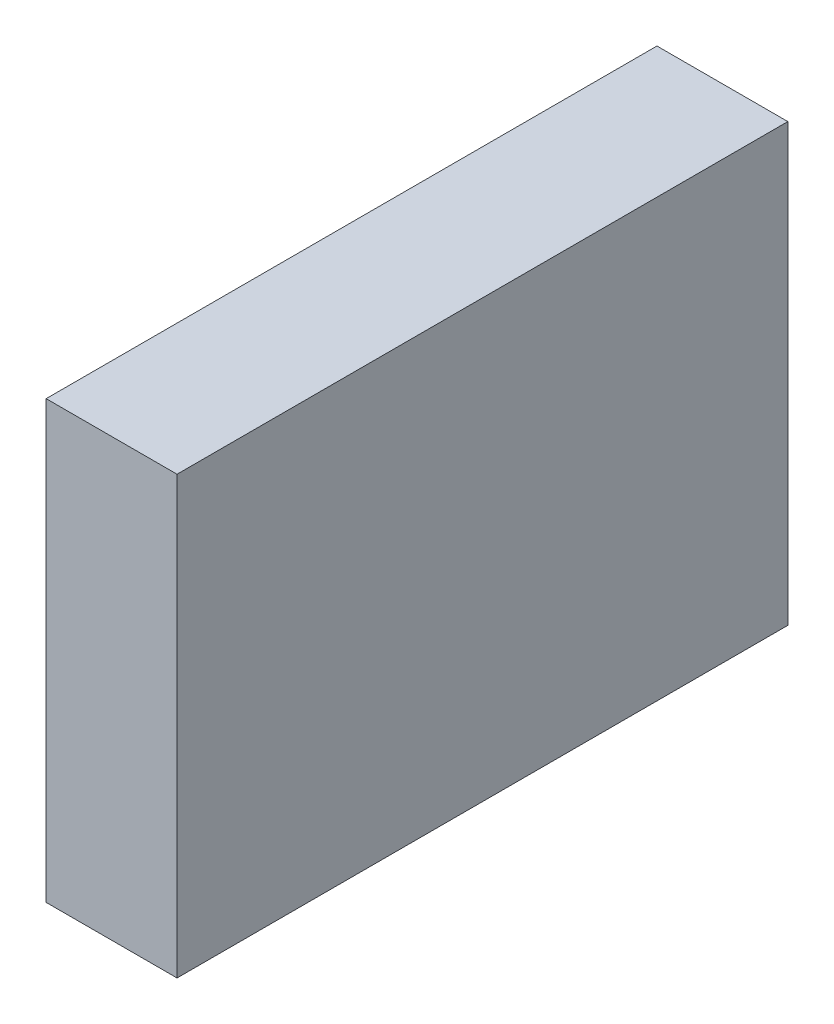
ISO-10303-21;
HEADER;
FILE_DESCRIPTION(('STEP AP214'),'2;1');
FILE_NAME('part.step','',(''),(''),'','','');
FILE_SCHEMA(('AUTOMOTIVE_DESIGN { 1 0 10303 214 1 1 1 1 }'));
ENDSEC;
DATA;
#1=APPLICATION_CONTEXT('core data for automotive mechanical design processes');
#2=APPLICATION_PROTOCOL_DEFINITION('international standard','automotive_design',2000,#1);
#3=PRODUCT_CONTEXT('',#1,'mechanical');
#4=PRODUCT('Part','Part','',(#3));
#5=PRODUCT_RELATED_PRODUCT_CATEGORY('part','',(#4));
#6=PRODUCT_DEFINITION_FORMATION('','',#4);
#7=PRODUCT_DEFINITION_CONTEXT('part definition',#1,'design');
#8=PRODUCT_DEFINITION('design','',#6,#7);
#9=PRODUCT_DEFINITION_SHAPE('','',#8);
#10=(LENGTH_UNIT() NAMED_UNIT(*) SI_UNIT(.MILLI.,.METRE.));
#11=(NAMED_UNIT(*) PLANE_ANGLE_UNIT() SI_UNIT($,.RADIAN.));
#12=(NAMED_UNIT(*) SI_UNIT($,.STERADIAN.) SOLID_ANGLE_UNIT());
#13=UNCERTAINTY_MEASURE_WITH_UNIT(LENGTH_MEASURE(1.E-05),#10,'distance_accuracy_value','');
#14=(GEOMETRIC_REPRESENTATION_CONTEXT(3) GLOBAL_UNCERTAINTY_ASSIGNED_CONTEXT((#13)) GLOBAL_UNIT_ASSIGNED_CONTEXT((#10,
#11,#12)) REPRESENTATION_CONTEXT('',''));
#15=CARTESIAN_POINT('',(0.,0.,0.));
#16=DIRECTION('',(0.,0.,1.));
#17=DIRECTION('',(1.,0.,0.));
#18=AXIS2_PLACEMENT_3D('',#15,#16,#17);
#19=CARTESIAN_POINT('',(3.89999968178106,-1.82000085936589,-3.72112168010555));
#20=DIRECTION('',(1.,-1.74845553146952E-07,0.));
#21=DIRECTION('',(1.74845553146952E-07,1.,8.74227765734759E-08));
#22=AXIS2_PLACEMENT_3D('',#19,#20,#21);
#23=PLANE('',#22);
#24=DIRECTION('',(0.,-8.74227765576152E-08,0.999999999999996));
#25=VECTOR('',#24,1.);
#26=CARTESIAN_POINT('',(3.8999998688658,-0.750000865483488,-3.65112158656318));
#27=LINE('',#26,#25);
#28=CARTESIAN_POINT('',(3.8999998688658,-0.750000865483488,-3.65112158656218));
#29=VERTEX_POINT('',#28);
#30=CARTESIAN_POINT('',(3.89999986886578,-0.750000987876375,-2.25112158656318));
#31=VERTEX_POINT('',#30);
#32=EDGE_CURVE('E11',#29,#31,#27,.T.);
#33=ORIENTED_EDGE('',*,*,#32,.F.);
#34=DIRECTION('',(1.74845553146599E-07,0.999999999999981,8.74227765732993E-08));
#35=VECTOR('',#34,1.);
#36=CARTESIAN_POINT('',(3.89999969402025,-1.75000086548549,-3.65112167398595));
#37=LINE('',#36,#35);
#38=CARTESIAN_POINT('',(3.89999969402025,-1.75000086548449,-3.65112167398595));
#39=VERTEX_POINT('',#38);
#40=EDGE_CURVE('E59',#39,#29,#37,.T.);
#41=ORIENTED_EDGE('',*,*,#40,.F.);
#42=DIRECTION('',(0.,8.74227766369168E-08,-0.999999999999996));
#43=VECTOR('',#42,1.);
#44=CARTESIAN_POINT('',(3.89999969402023,-1.75000098787738,-2.25112167398595));
#45=LINE('',#44,#43);
#46=CARTESIAN_POINT('',(3.89999969402023,-1.75000098787738,-2.25112167398695));
#47=VERTEX_POINT('',#46);
#48=EDGE_CURVE('E79',#47,#39,#45,.T.);
#49=ORIENTED_EDGE('',*,*,#48,.F.);
#50=DIRECTION('',(-1.74845553146599E-07,-0.999999999999981,-8.74227765732994E-08));
#51=VECTOR('',#50,1.);
#52=CARTESIAN_POINT('',(3.89999986886578,-0.750000987875375,-2.25112158656318));
#53=LINE('',#52,#51);
#54=EDGE_CURVE('E84',#31,#47,#53,.T.);
#55=ORIENTED_EDGE('',*,*,#54,.F.);
#56=EDGE_LOOP('',(#33,#41,#49,#55));
#57=FACE_BOUND('',#56,.T.);
#58=ADVANCED_FACE('F17',(#57),#23,.F.);
#59=CARTESIAN_POINT('',(4.19999968178106,-1.82000091181956,-3.72112168010555));
#60=DIRECTION('',(1.,-1.74845553146952E-07,0.));
#61=DIRECTION('',(1.74845553146952E-07,1.,8.74227765734759E-08));
#62=AXIS2_PLACEMENT_3D('',#59,#60,#61);
#63=PLANE('',#62);
#64=DIRECTION('',(-1.74845553146599E-07,-0.999999999999981,-8.74227765732994E-08));
#65=VECTOR('',#64,1.);
#66=CARTESIAN_POINT('',(4.19999986886578,-0.750001040329042,-2.25112158656318));
#67=LINE('',#66,#65);
#68=CARTESIAN_POINT('',(4.19999986886578,-0.750001040330041,-2.25112158656318));
#69=VERTEX_POINT('',#68);
#70=CARTESIAN_POINT('',(4.19999969402023,-1.75000104033104,-2.25112167398695));
#71=VERTEX_POINT('',#70);
#72=EDGE_CURVE('E24',#69,#71,#67,.T.);
#73=ORIENTED_EDGE('',*,*,#72,.T.);
#74=DIRECTION('',(0.,8.74227764783136E-08,-0.999999999999996));
#75=VECTOR('',#74,1.);
#76=CARTESIAN_POINT('',(4.19999969402023,-1.75000104033104,-2.25112167398595));
#77=LINE('',#76,#75);
#78=CARTESIAN_POINT('',(4.19999969402025,-1.75000091793815,-3.65112167398595));
#79=VERTEX_POINT('',#78);
#80=EDGE_CURVE('E82',#71,#79,#77,.T.);
#81=ORIENTED_EDGE('',*,*,#80,.T.);
#82=DIRECTION('',(1.74845553146599E-07,0.999999999999981,8.74227765732993E-08));
#83=VECTOR('',#82,1.);
#84=CARTESIAN_POINT('',(4.19999969402025,-1.75000091793915,-3.65112167398595));
#85=LINE('',#84,#83);
#86=CARTESIAN_POINT('',(4.1999998688658,-0.750000917937154,-3.65112158656218));
#87=VERTEX_POINT('',#86);
#88=EDGE_CURVE('E64',#79,#87,#85,.T.);
#89=ORIENTED_EDGE('',*,*,#88,.T.);
#90=DIRECTION('',(0.,-8.74227765576152E-08,0.999999999999996));
#91=VECTOR('',#90,1.);
#92=CARTESIAN_POINT('',(4.1999998688658,-0.750000917937154,-3.65112158656318));
#93=LINE('',#92,#91);
#94=EDGE_CURVE('E61',#87,#69,#93,.T.);
#95=ORIENTED_EDGE('',*,*,#94,.T.);
#96=EDGE_LOOP('',(#73,#81,#89,#95));
#97=FACE_BOUND('',#96,.T.);
#98=ADVANCED_FACE('F62',(#97),#63,.T.);
#99=CARTESIAN_POINT('',(3.89999986886578,-0.750000987875375,-2.25112158656318));
#100=DIRECTION('',(0.,-8.74227765734759E-08,1.));
#101=DIRECTION('',(-1.74845553146952E-07,-1.,-8.74227765734759E-08));
#102=AXIS2_PLACEMENT_3D('',#99,#100,#101);
#103=PLANE('',#102);
#104=ORIENTED_EDGE('',*,*,#54,.T.);
#105=DIRECTION('',(0.999999999999985,-1.74845552850889E-07,0.));
#106=VECTOR('',#105,1.);
#107=CARTESIAN_POINT('',(3.89999969402023,-1.75000098787737,-2.25112167398595));
#108=LINE('',#107,#106);
#109=EDGE_CURVE('E57',#47,#71,#108,.T.);
#110=ORIENTED_EDGE('',*,*,#109,.T.);
#111=ORIENTED_EDGE('',*,*,#72,.F.);
#112=DIRECTION('',(0.999999999999985,-1.74845553220963E-07,0.));
#113=VECTOR('',#112,1.);
#114=CARTESIAN_POINT('',(3.89999986886578,-0.750000987875375,-2.25112158656318));
#115=LINE('',#114,#113);
#116=EDGE_CURVE('E55',#31,#69,#115,.T.);
#117=ORIENTED_EDGE('',*,*,#116,.F.);
#118=EDGE_LOOP('',(#104,#110,#111,#117));
#119=FACE_BOUND('',#118,.T.);
#120=ADVANCED_FACE('F53',(#119),#103,.T.);
#121=CARTESIAN_POINT('',(3.89999969402023,-1.75000098787738,-2.25112167398595));
#122=DIRECTION('',(-1.74845553146952E-07,-1.,-8.74227765734759E-08));
#123=DIRECTION('',(0.,8.74227765734759E-08,-1.));
#124=AXIS2_PLACEMENT_3D('',#121,#122,#123);
#125=PLANE('',#124);
#126=ORIENTED_EDGE('',*,*,#48,.T.);
#127=DIRECTION('',(0.999999999999985,-1.74845552850889E-07,0.));
#128=VECTOR('',#127,1.);
#129=CARTESIAN_POINT('',(3.89999969402025,-1.75000086548549,-3.65112167398595));
#130=LINE('',#129,#128);
#131=EDGE_CURVE('E68',#39,#79,#130,.T.);
#132=ORIENTED_EDGE('',*,*,#131,.T.);
#133=ORIENTED_EDGE('',*,*,#80,.F.);
#134=ORIENTED_EDGE('',*,*,#109,.F.);
#135=EDGE_LOOP('',(#126,#132,#133,#134));
#136=FACE_BOUND('',#135,.T.);
#137=ADVANCED_FACE('F91',(#136),#125,.T.);
#138=CARTESIAN_POINT('',(3.89999969402025,-1.75000086548549,-3.65112167398595));
#139=DIRECTION('',(0.,8.74227765734759E-08,-1.));
#140=DIRECTION('',(1.74845553146952E-07,1.,8.74227765734759E-08));
#141=AXIS2_PLACEMENT_3D('',#138,#139,#140);
#142=PLANE('',#141);
#143=ORIENTED_EDGE('',*,*,#40,.T.);
#144=DIRECTION('',(0.999999999999985,-1.74845553220963E-07,0.));
#145=VECTOR('',#144,1.);
#146=CARTESIAN_POINT('',(3.8999998688658,-0.750000865483488,-3.65112158656318));
#147=LINE('',#146,#145);
#148=EDGE_CURVE('E69',#29,#87,#147,.T.);
#149=ORIENTED_EDGE('',*,*,#148,.T.);
#150=ORIENTED_EDGE('',*,*,#88,.F.);
#151=ORIENTED_EDGE('',*,*,#131,.F.);
#152=EDGE_LOOP('',(#143,#149,#150,#151));
#153=FACE_BOUND('',#152,.T.);
#154=ADVANCED_FACE('F88',(#153),#142,.T.);
#155=CARTESIAN_POINT('',(3.8999998688658,-0.750000865483488,-3.65112158656318));
#156=DIRECTION('',(1.74845553146952E-07,1.,8.74227765734759E-08));
#157=DIRECTION('',(0.,-8.74227765734759E-08,1.));
#158=AXIS2_PLACEMENT_3D('',#155,#156,#157);
#159=PLANE('',#158);
#160=ORIENTED_EDGE('',*,*,#32,.T.);
#161=ORIENTED_EDGE('',*,*,#116,.T.);
#162=ORIENTED_EDGE('',*,*,#94,.F.);
#163=ORIENTED_EDGE('',*,*,#148,.F.);
#164=EDGE_LOOP('',(#160,#161,#162,#163));
#165=FACE_BOUND('',#164,.T.);
#166=ADVANCED_FACE('F71',(#165),#159,.T.);
#167=CLOSED_SHELL('',(#58,#98,#120,#137,#154,#166));
#168=MANIFOLD_SOLID_BREP('B1',#167);
#169=ADVANCED_BREP_SHAPE_REPRESENTATION('',(#18,#168),#14);
#170=SHAPE_DEFINITION_REPRESENTATION(#9,#169);
ENDSEC;
END-ISO-10303-21;
